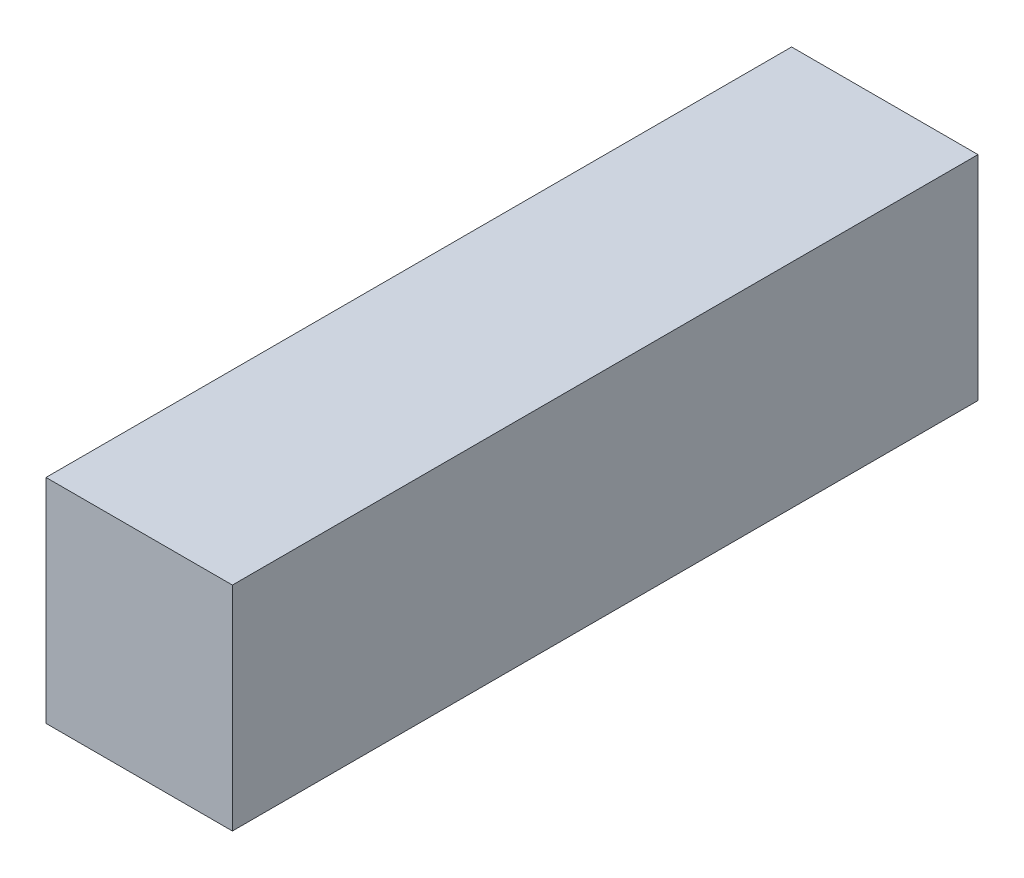
ISO-10303-21;
HEADER;
FILE_DESCRIPTION(('STEP AP214'),'2;1');
FILE_NAME('part.step','',(''),(''),'','','');
FILE_SCHEMA(('AUTOMOTIVE_DESIGN { 1 0 10303 214 1 1 1 1 }'));
ENDSEC;
DATA;
#1=APPLICATION_CONTEXT('core data for automotive mechanical design processes');
#2=APPLICATION_PROTOCOL_DEFINITION('international standard','automotive_design',2000,#1);
#3=PRODUCT_CONTEXT('',#1,'mechanical');
#4=PRODUCT('Part','Part','',(#3));
#5=PRODUCT_RELATED_PRODUCT_CATEGORY('part','',(#4));
#6=PRODUCT_DEFINITION_FORMATION('','',#4);
#7=PRODUCT_DEFINITION_CONTEXT('part definition',#1,'design');
#8=PRODUCT_DEFINITION('design','',#6,#7);
#9=PRODUCT_DEFINITION_SHAPE('','',#8);
#10=(LENGTH_UNIT() NAMED_UNIT(*) SI_UNIT(.MILLI.,.METRE.));
#11=(NAMED_UNIT(*) PLANE_ANGLE_UNIT() SI_UNIT($,.RADIAN.));
#12=(NAMED_UNIT(*) SI_UNIT($,.STERADIAN.) SOLID_ANGLE_UNIT());
#13=UNCERTAINTY_MEASURE_WITH_UNIT(LENGTH_MEASURE(1.E-05),#10,'distance_accuracy_value','');
#14=(GEOMETRIC_REPRESENTATION_CONTEXT(3) GLOBAL_UNCERTAINTY_ASSIGNED_CONTEXT((#13)) GLOBAL_UNIT_ASSIGNED_CONTEXT((#10,
#11,#12)) REPRESENTATION_CONTEXT('',''));
#15=CARTESIAN_POINT('',(0.,0.,0.));
#16=DIRECTION('',(0.,0.,1.));
#17=DIRECTION('',(1.,0.,0.));
#18=AXIS2_PLACEMENT_3D('',#15,#16,#17);
#19=CARTESIAN_POINT('',(17.5,40.,70.));
#20=DIRECTION('',(-1.,0.,0.));
#21=DIRECTION('',(0.,0.,1.));
#22=AXIS2_PLACEMENT_3D('',#19,#20,#21);
#23=PLANE('',#22);
#24=DIRECTION('',(0.,0.,-1.));
#25=VECTOR('',#24,1.);
#26=CARTESIAN_POINT('',(17.5,0.,70.));
#27=LINE('',#26,#25);
#28=CARTESIAN_POINT('',(17.5,0.,70.));
#29=VERTEX_POINT('',#28);
#30=CARTESIAN_POINT('',(17.5,0.,-70.));
#31=VERTEX_POINT('',#30);
#32=EDGE_CURVE('E96',#29,#31,#27,.T.);
#33=ORIENTED_EDGE('',*,*,#32,.T.);
#34=DIRECTION('',(0.,-1.,0.));
#35=VECTOR('',#34,1.);
#36=CARTESIAN_POINT('',(17.5,40.,-70.));
#37=LINE('',#36,#35);
#38=CARTESIAN_POINT('',(17.5,40.,-70.));
#39=VERTEX_POINT('',#38);
#40=EDGE_CURVE('E11',#39,#31,#37,.T.);
#41=ORIENTED_EDGE('',*,*,#40,.F.);
#42=DIRECTION('',(0.,0.,-1.));
#43=VECTOR('',#42,1.);
#44=CARTESIAN_POINT('',(17.5,40.,70.));
#45=LINE('',#44,#43);
#46=CARTESIAN_POINT('',(17.5,40.,70.));
#47=VERTEX_POINT('',#46);
#48=EDGE_CURVE('E84',#47,#39,#45,.T.);
#49=ORIENTED_EDGE('',*,*,#48,.F.);
#50=DIRECTION('',(0.,-1.,0.));
#51=VECTOR('',#50,1.);
#52=CARTESIAN_POINT('',(17.5,40.,70.));
#53=LINE('',#52,#51);
#54=EDGE_CURVE('E92',#47,#29,#53,.T.);
#55=ORIENTED_EDGE('',*,*,#54,.T.);
#56=EDGE_LOOP('',(#33,#41,#49,#55));
#57=FACE_BOUND('',#56,.T.);
#58=ADVANCED_FACE('F33',(#57),#23,.F.);
#59=CARTESIAN_POINT('',(-17.5,40.,-70.));
#60=DIRECTION('',(0.,0.,1.));
#61=DIRECTION('',(1.,0.,0.));
#62=AXIS2_PLACEMENT_3D('',#59,#60,#61);
#63=PLANE('',#62);
#64=DIRECTION('',(-1.,0.,0.));
#65=VECTOR('',#64,1.);
#66=CARTESIAN_POINT('',(-17.5,0.,-70.));
#67=LINE('',#66,#65);
#68=CARTESIAN_POINT('',(-17.5,0.,-70.));
#69=VERTEX_POINT('',#68);
#70=EDGE_CURVE('E88',#31,#69,#67,.T.);
#71=ORIENTED_EDGE('',*,*,#70,.T.);
#72=DIRECTION('',(0.,-1.,0.));
#73=VECTOR('',#72,1.);
#74=CARTESIAN_POINT('',(-17.5,40.,-70.));
#75=LINE('',#74,#73);
#76=CARTESIAN_POINT('',(-17.5,40.,-70.));
#77=VERTEX_POINT('',#76);
#78=EDGE_CURVE('E41',#77,#69,#75,.T.);
#79=ORIENTED_EDGE('',*,*,#78,.F.);
#80=DIRECTION('',(-1.,0.,0.));
#81=VECTOR('',#80,1.);
#82=CARTESIAN_POINT('',(-17.5,40.,-70.));
#83=LINE('',#82,#81);
#84=EDGE_CURVE('E79',#39,#77,#83,.T.);
#85=ORIENTED_EDGE('',*,*,#84,.F.);
#86=ORIENTED_EDGE('',*,*,#40,.T.);
#87=EDGE_LOOP('',(#71,#79,#85,#86));
#88=FACE_BOUND('',#87,.T.);
#89=ADVANCED_FACE('F87',(#88),#63,.F.);
#90=CARTESIAN_POINT('',(-17.5,40.,70.));
#91=DIRECTION('',(1.,0.,0.));
#92=DIRECTION('',(0.,0.,-1.));
#93=AXIS2_PLACEMENT_3D('',#90,#91,#92);
#94=PLANE('',#93);
#95=DIRECTION('',(0.,0.,1.));
#96=VECTOR('',#95,1.);
#97=CARTESIAN_POINT('',(-17.5,0.,70.));
#98=LINE('',#97,#96);
#99=CARTESIAN_POINT('',(-17.5,0.,70.));
#100=VERTEX_POINT('',#99);
#101=EDGE_CURVE('E66',#69,#100,#98,.T.);
#102=ORIENTED_EDGE('',*,*,#101,.T.);
#103=DIRECTION('',(0.,-1.,0.));
#104=VECTOR('',#103,1.);
#105=CARTESIAN_POINT('',(-17.5,40.,70.));
#106=LINE('',#105,#104);
#107=CARTESIAN_POINT('',(-17.5,40.,70.));
#108=VERTEX_POINT('',#107);
#109=EDGE_CURVE('E89',#108,#100,#106,.T.);
#110=ORIENTED_EDGE('',*,*,#109,.F.);
#111=DIRECTION('',(0.,0.,1.));
#112=VECTOR('',#111,1.);
#113=CARTESIAN_POINT('',(-17.5,40.,70.));
#114=LINE('',#113,#112);
#115=EDGE_CURVE('E82',#77,#108,#114,.T.);
#116=ORIENTED_EDGE('',*,*,#115,.F.);
#117=ORIENTED_EDGE('',*,*,#78,.T.);
#118=EDGE_LOOP('',(#102,#110,#116,#117));
#119=FACE_BOUND('',#118,.T.);
#120=ADVANCED_FACE('F90',(#119),#94,.F.);
#121=CARTESIAN_POINT('',(-17.5,40.,70.));
#122=DIRECTION('',(0.,0.,-1.));
#123=DIRECTION('',(-1.,0.,0.));
#124=AXIS2_PLACEMENT_3D('',#121,#122,#123);
#125=PLANE('',#124);
#126=DIRECTION('',(1.,0.,0.));
#127=VECTOR('',#126,1.);
#128=CARTESIAN_POINT('',(-17.5,0.,70.));
#129=LINE('',#128,#127);
#130=EDGE_CURVE('E72',#100,#29,#129,.T.);
#131=ORIENTED_EDGE('',*,*,#130,.T.);
#132=ORIENTED_EDGE('',*,*,#54,.F.);
#133=DIRECTION('',(1.,0.,0.));
#134=VECTOR('',#133,1.);
#135=CARTESIAN_POINT('',(-17.5,40.,70.));
#136=LINE('',#135,#134);
#137=EDGE_CURVE('E49',#108,#47,#136,.T.);
#138=ORIENTED_EDGE('',*,*,#137,.F.);
#139=ORIENTED_EDGE('',*,*,#109,.T.);
#140=EDGE_LOOP('',(#131,#132,#138,#139));
#141=FACE_BOUND('',#140,.T.);
#142=ADVANCED_FACE('F103',(#141),#125,.F.);
#143=CARTESIAN_POINT('',(0.,40.,0.));
#144=DIRECTION('',(0.,-1.,0.));
#145=DIRECTION('',(0.,0.,-1.));
#146=AXIS2_PLACEMENT_3D('',#143,#144,#145);
#147=PLANE('',#146);
#148=ORIENTED_EDGE('',*,*,#48,.T.);
#149=ORIENTED_EDGE('',*,*,#84,.T.);
#150=ORIENTED_EDGE('',*,*,#115,.T.);
#151=ORIENTED_EDGE('',*,*,#137,.T.);
#152=EDGE_LOOP('',(#148,#149,#150,#151));
#153=FACE_BOUND('',#152,.T.);
#154=ADVANCED_FACE('F80',(#153),#147,.F.);
#155=CARTESIAN_POINT('',(0.,0.,0.));
#156=DIRECTION('',(0.,-1.,0.));
#157=DIRECTION('',(0.,0.,-1.));
#158=AXIS2_PLACEMENT_3D('',#155,#156,#157);
#159=PLANE('',#158);
#160=ORIENTED_EDGE('',*,*,#32,.F.);
#161=ORIENTED_EDGE('',*,*,#130,.F.);
#162=ORIENTED_EDGE('',*,*,#101,.F.);
#163=ORIENTED_EDGE('',*,*,#70,.F.);
#164=EDGE_LOOP('',(#160,#161,#162,#163));
#165=FACE_BOUND('',#164,.T.);
#166=ADVANCED_FACE('F106',(#165),#159,.T.);
#167=CLOSED_SHELL('',(#58,#89,#120,#142,#154,#166));
#168=MANIFOLD_SOLID_BREP('B2',#167);
#169=ADVANCED_BREP_SHAPE_REPRESENTATION('',(#18,#168),#14);
#170=SHAPE_DEFINITION_REPRESENTATION(#9,#169);
ENDSEC;
END-ISO-10303-21;
